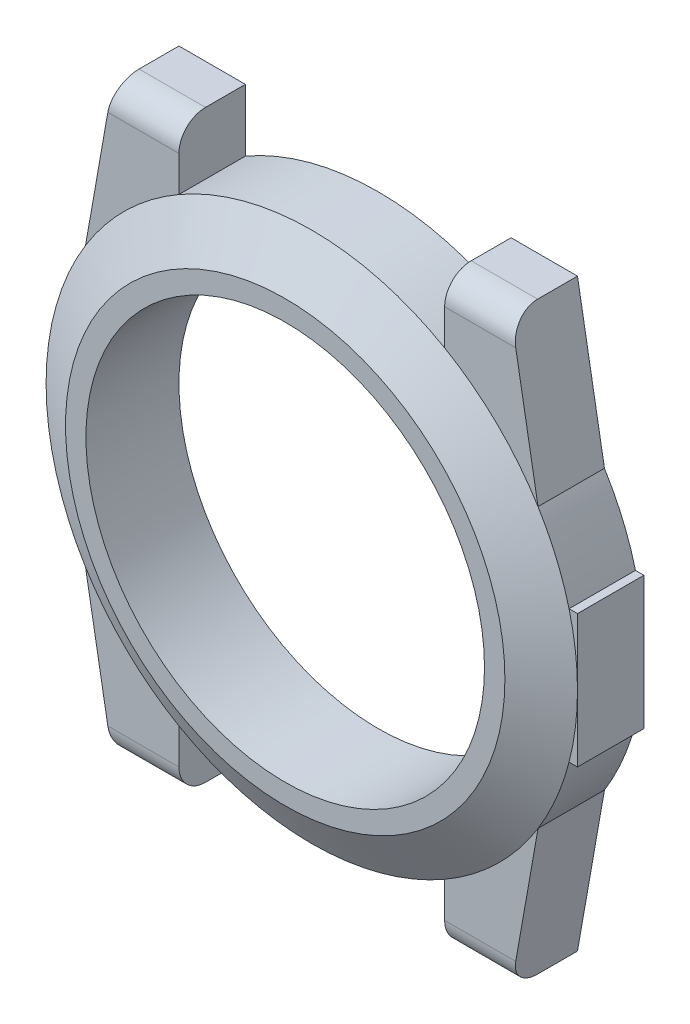
ISO-10303-21;
HEADER;
FILE_DESCRIPTION(('STEP AP214'),'2;1');
FILE_NAME('part.step','',(''),(''),'','','');
FILE_SCHEMA(('AUTOMOTIVE_DESIGN { 1 0 10303 214 1 1 1 1 }'));
ENDSEC;
DATA;
#1=APPLICATION_CONTEXT('core data for automotive mechanical design processes');
#2=APPLICATION_PROTOCOL_DEFINITION('international standard','automotive_design',2000,#1);
#3=PRODUCT_CONTEXT('',#1,'mechanical');
#4=PRODUCT('Part','Part','',(#3));
#5=PRODUCT_RELATED_PRODUCT_CATEGORY('part','',(#4));
#6=PRODUCT_DEFINITION_FORMATION('','',#4);
#7=PRODUCT_DEFINITION_CONTEXT('part definition',#1,'design');
#8=PRODUCT_DEFINITION('design','',#6,#7);
#9=PRODUCT_DEFINITION_SHAPE('','',#8);
#10=(LENGTH_UNIT() NAMED_UNIT(*) SI_UNIT(.MILLI.,.METRE.));
#11=(NAMED_UNIT(*) PLANE_ANGLE_UNIT() SI_UNIT($,.RADIAN.));
#12=(NAMED_UNIT(*) SI_UNIT($,.STERADIAN.) SOLID_ANGLE_UNIT());
#13=UNCERTAINTY_MEASURE_WITH_UNIT(LENGTH_MEASURE(1.E-05),#10,'distance_accuracy_value','');
#14=(GEOMETRIC_REPRESENTATION_CONTEXT(3) GLOBAL_UNCERTAINTY_ASSIGNED_CONTEXT((#13)) GLOBAL_UNIT_ASSIGNED_CONTEXT((#10,
#11,#12)) REPRESENTATION_CONTEXT('',''));
#15=CARTESIAN_POINT('',(0.,0.,0.));
#16=DIRECTION('',(0.,0.,1.));
#17=DIRECTION('',(1.,0.,0.));
#18=AXIS2_PLACEMENT_3D('',#15,#16,#17);
#19=CARTESIAN_POINT('',(0.,0.,5.));
#20=DIRECTION('',(0.,0.,-1.));
#21=DIRECTION('',(-1.,0.,0.));
#22=AXIS2_PLACEMENT_3D('',#19,#20,#21);
#23=CYLINDRICAL_SURFACE('',#22,20.);
#24=DIRECTION('',(0.,0.,-1.));
#25=VECTOR('',#24,1.);
#26=CARTESIAN_POINT('',(19.3649167310371,-5.00000000000001,5.));
#27=LINE('',#26,#25);
#28=CARTESIAN_POINT('',(19.3649167310371,-5.00000000000001,5.));
#29=VERTEX_POINT('',#28);
#30=CARTESIAN_POINT('',(19.3649167310371,-5.00000000000001,0.));
#31=VERTEX_POINT('',#30);
#32=EDGE_CURVE('E243',#29,#31,#27,.T.);
#33=ORIENTED_EDGE('',*,*,#32,.F.);
#34=CARTESIAN_POINT('',(0.,0.,5.));
#35=DIRECTION('',(0.,0.,1.));
#36=DIRECTION('',(1.,0.,0.));
#37=AXIS2_PLACEMENT_3D('',#34,#35,#36);
#38=CIRCLE('',#37,20.);
#39=CARTESIAN_POINT('',(17.0300508577456,-10.4870094775679,5.));
#40=VERTEX_POINT('',#39);
#41=EDGE_CURVE('E230',#29,#40,#38,.F.);
#42=ORIENTED_EDGE('',*,*,#41,.T.);
#43=DIRECTION('',(0.,0.,-1.));
#44=VECTOR('',#43,1.);
#45=CARTESIAN_POINT('',(17.0300508577456,-10.4870094775679,5.));
#46=LINE('',#45,#44);
#47=CARTESIAN_POINT('',(17.0300508577456,-10.4870094775679,0.));
#48=VERTEX_POINT('',#47);
#49=EDGE_CURVE('E246',#40,#48,#46,.T.);
#50=ORIENTED_EDGE('',*,*,#49,.T.);
#51=CARTESIAN_POINT('',(0.,0.,0.));
#52=DIRECTION('',(0.,0.,1.));
#53=DIRECTION('',(1.,0.,0.));
#54=AXIS2_PLACEMENT_3D('',#51,#52,#53);
#55=CIRCLE('',#54,20.);
#56=EDGE_CURVE('E483',#48,#31,#55,.T.);
#57=ORIENTED_EDGE('',*,*,#56,.T.);
#58=EDGE_LOOP('',(#33,#42,#50,#57));
#59=FACE_BOUND('',#58,.T.);
#60=ADVANCED_FACE('F33',(#59),#23,.T.);
#61=DIRECTION('',(0.,0.,-1.));
#62=VECTOR('',#61,1.);
#63=CARTESIAN_POINT('',(10.,-17.3205080756888,5.));
#64=LINE('',#63,#62);
#65=CARTESIAN_POINT('',(10.,-17.3205080756888,5.));
#66=VERTEX_POINT('',#65);
#67=CARTESIAN_POINT('',(10.,-17.3205080756888,0.));
#68=VERTEX_POINT('',#67);
#69=EDGE_CURVE('E286',#66,#68,#64,.T.);
#70=ORIENTED_EDGE('',*,*,#69,.F.);
#71=CARTESIAN_POINT('',(0.,0.,5.));
#72=DIRECTION('',(0.,0.,1.));
#73=DIRECTION('',(1.,0.,0.));
#74=AXIS2_PLACEMENT_3D('',#71,#72,#73);
#75=CIRCLE('',#74,20.);
#76=CARTESIAN_POINT('',(-10.,-17.3205080756888,5.));
#77=VERTEX_POINT('',#76);
#78=EDGE_CURVE('E383',#66,#77,#75,.F.);
#79=ORIENTED_EDGE('',*,*,#78,.T.);
#80=DIRECTION('',(0.,0.,-1.));
#81=VECTOR('',#80,1.);
#82=CARTESIAN_POINT('',(-10.,-17.3205080756888,5.));
#83=LINE('',#82,#81);
#84=CARTESIAN_POINT('',(-10.,-17.3205080756888,0.));
#85=VERTEX_POINT('',#84);
#86=EDGE_CURVE('E282',#77,#85,#83,.T.);
#87=ORIENTED_EDGE('',*,*,#86,.T.);
#88=CARTESIAN_POINT('',(0.,0.,0.));
#89=DIRECTION('',(0.,0.,1.));
#90=DIRECTION('',(1.,0.,0.));
#91=AXIS2_PLACEMENT_3D('',#88,#89,#90);
#92=CIRCLE('',#91,20.);
#93=EDGE_CURVE('E412',#85,#68,#92,.T.);
#94=ORIENTED_EDGE('',*,*,#93,.T.);
#95=EDGE_LOOP('',(#70,#79,#87,#94));
#96=FACE_BOUND('',#95,.T.);
#97=ADVANCED_FACE('F409',(#96),#23,.T.);
#98=DIRECTION('',(0.,0.,-1.));
#99=VECTOR('',#98,1.);
#100=CARTESIAN_POINT('',(-17.0300508577456,-10.4870094775679,5.));
#101=LINE('',#100,#99);
#102=CARTESIAN_POINT('',(-17.0300508577456,-10.4870094775679,5.));
#103=VERTEX_POINT('',#102);
#104=CARTESIAN_POINT('',(-17.0300508577456,-10.4870094775679,0.));
#105=VERTEX_POINT('',#104);
#106=EDGE_CURVE('E289',#103,#105,#101,.T.);
#107=ORIENTED_EDGE('',*,*,#106,.F.);
#108=CARTESIAN_POINT('',(0.,0.,5.));
#109=DIRECTION('',(0.,0.,1.));
#110=DIRECTION('',(1.,0.,0.));
#111=AXIS2_PLACEMENT_3D('',#108,#109,#110);
#112=CIRCLE('',#111,20.);
#113=CARTESIAN_POINT('',(-17.0300508577456,10.4870094775679,5.));
#114=VERTEX_POINT('',#113);
#115=EDGE_CURVE('E378',#103,#114,#112,.F.);
#116=ORIENTED_EDGE('',*,*,#115,.T.);
#117=DIRECTION('',(0.,0.,-1.));
#118=VECTOR('',#117,1.);
#119=CARTESIAN_POINT('',(-17.0300508577456,10.4870094775679,5.));
#120=LINE('',#119,#118);
#121=CARTESIAN_POINT('',(-17.0300508577456,10.4870094775679,0.));
#122=VERTEX_POINT('',#121);
#123=EDGE_CURVE('E292',#114,#122,#120,.T.);
#124=ORIENTED_EDGE('',*,*,#123,.T.);
#125=CARTESIAN_POINT('',(0.,0.,0.));
#126=DIRECTION('',(0.,0.,1.));
#127=DIRECTION('',(1.,0.,0.));
#128=AXIS2_PLACEMENT_3D('',#125,#126,#127);
#129=CIRCLE('',#128,20.);
#130=EDGE_CURVE('E465',#122,#105,#129,.T.);
#131=ORIENTED_EDGE('',*,*,#130,.T.);
#132=EDGE_LOOP('',(#107,#116,#124,#131));
#133=FACE_BOUND('',#132,.T.);
#134=ADVANCED_FACE('F550',(#133),#23,.T.);
#135=DIRECTION('',(0.,0.,-1.));
#136=VECTOR('',#135,1.);
#137=CARTESIAN_POINT('',(-10.,17.3205080756888,5.));
#138=LINE('',#137,#136);
#139=CARTESIAN_POINT('',(-10.,17.3205080756888,5.));
#140=VERTEX_POINT('',#139);
#141=CARTESIAN_POINT('',(-10.,17.3205080756888,0.));
#142=VERTEX_POINT('',#141);
#143=EDGE_CURVE('E232',#140,#142,#138,.T.);
#144=ORIENTED_EDGE('',*,*,#143,.F.);
#145=CARTESIAN_POINT('',(0.,0.,5.));
#146=DIRECTION('',(0.,0.,1.));
#147=DIRECTION('',(1.,0.,0.));
#148=AXIS2_PLACEMENT_3D('',#145,#146,#147);
#149=CIRCLE('',#148,20.);
#150=CARTESIAN_POINT('',(10.,17.3205080756888,5.));
#151=VERTEX_POINT('',#150);
#152=EDGE_CURVE('E373',#140,#151,#149,.F.);
#153=ORIENTED_EDGE('',*,*,#152,.T.);
#154=DIRECTION('',(0.,0.,-1.));
#155=VECTOR('',#154,1.);
#156=CARTESIAN_POINT('',(10.,17.3205080756888,5.));
#157=LINE('',#156,#155);
#158=CARTESIAN_POINT('',(10.,17.3205080756888,0.));
#159=VERTEX_POINT('',#158);
#160=EDGE_CURVE('E339',#151,#159,#157,.T.);
#161=ORIENTED_EDGE('',*,*,#160,.T.);
#162=CARTESIAN_POINT('',(0.,0.,0.));
#163=DIRECTION('',(0.,0.,1.));
#164=DIRECTION('',(1.,0.,0.));
#165=AXIS2_PLACEMENT_3D('',#162,#163,#164);
#166=CIRCLE('',#165,20.);
#167=EDGE_CURVE('E458',#159,#142,#166,.T.);
#168=ORIENTED_EDGE('',*,*,#167,.T.);
#169=EDGE_LOOP('',(#144,#153,#161,#168));
#170=FACE_BOUND('',#169,.T.);
#171=ADVANCED_FACE('F522',(#170),#23,.T.);
#172=CARTESIAN_POINT('',(0.,0.,5.));
#173=DIRECTION('',(0.,0.,1.));
#174=DIRECTION('',(1.,0.,0.));
#175=AXIS2_PLACEMENT_3D('',#172,#173,#174);
#176=PLANE('',#175);
#177=DIRECTION('',(-0.173648177666927,0.984807753012209,0.));
#178=VECTOR('',#177,1.);
#179=CARTESIAN_POINT('',(15.,22.,5.));
#180=LINE('',#179,#178);
#181=CARTESIAN_POINT('',(17.0300508577456,10.4870094775679,5.));
#182=VERTEX_POINT('',#181);
#183=CARTESIAN_POINT('',(15.3526539614169,20.,5.));
#184=VERTEX_POINT('',#183);
#185=EDGE_CURVE('E340',#182,#184,#180,.T.);
#186=ORIENTED_EDGE('',*,*,#185,.T.);
#187=DIRECTION('',(-1.,0.,0.));
#188=VECTOR('',#187,1.);
#189=CARTESIAN_POINT('',(10.,20.,5.));
#190=LINE('',#189,#188);
#191=CARTESIAN_POINT('',(10.,20.,5.));
#192=VERTEX_POINT('',#191);
#193=EDGE_CURVE('E330',#184,#192,#190,.T.);
#194=ORIENTED_EDGE('',*,*,#193,.T.);
#195=DIRECTION('',(0.,-1.,0.));
#196=VECTOR('',#195,1.);
#197=CARTESIAN_POINT('',(10.,17.3205080756888,5.));
#198=LINE('',#197,#196);
#199=EDGE_CURVE('E336',#192,#151,#198,.T.);
#200=ORIENTED_EDGE('',*,*,#199,.T.);
#201=CARTESIAN_POINT('',(0.,0.,5.));
#202=DIRECTION('',(0.,0.,1.));
#203=DIRECTION('',(1.,0.,0.));
#204=AXIS2_PLACEMENT_3D('',#201,#202,#203);
#205=CIRCLE('',#204,20.);
#206=EDGE_CURVE('E304',#182,#151,#205,.T.);
#207=ORIENTED_EDGE('',*,*,#206,.F.);
#208=EDGE_LOOP('',(#186,#194,#200,#207));
#209=FACE_BOUND('',#208,.T.);
#210=ADVANCED_FACE('F516',(#209),#176,.T.);
#211=DIRECTION('',(0.,1.,0.));
#212=VECTOR('',#211,1.);
#213=CARTESIAN_POINT('',(-10.,17.3205080756888,5.));
#214=LINE('',#213,#212);
#215=CARTESIAN_POINT('',(-10.,20.,5.));
#216=VERTEX_POINT('',#215);
#217=EDGE_CURVE('E311',#140,#216,#214,.T.);
#218=ORIENTED_EDGE('',*,*,#217,.T.);
#219=DIRECTION('',(-1.,0.,0.));
#220=VECTOR('',#219,1.);
#221=CARTESIAN_POINT('',(-15.,20.,5.));
#222=LINE('',#221,#220);
#223=CARTESIAN_POINT('',(-15.3526539614169,20.,5.));
#224=VERTEX_POINT('',#223);
#225=EDGE_CURVE('E314',#216,#224,#222,.T.);
#226=ORIENTED_EDGE('',*,*,#225,.T.);
#227=DIRECTION('',(-0.173648177666927,-0.984807753012209,0.));
#228=VECTOR('',#227,1.);
#229=CARTESIAN_POINT('',(-15.,22.,5.));
#230=LINE('',#229,#228);
#231=EDGE_CURVE('E298',#224,#114,#230,.T.);
#232=ORIENTED_EDGE('',*,*,#231,.T.);
#233=EDGE_CURVE('E301',#140,#114,#205,.T.);
#234=ORIENTED_EDGE('',*,*,#233,.F.);
#235=EDGE_LOOP('',(#218,#226,#232,#234));
#236=FACE_BOUND('',#235,.T.);
#237=ADVANCED_FACE('F567',(#236),#176,.T.);
#238=DIRECTION('',(0.173648177666927,-0.984807753012209,0.));
#239=VECTOR('',#238,1.);
#240=CARTESIAN_POINT('',(-15.,-22.,5.));
#241=LINE('',#240,#239);
#242=CARTESIAN_POINT('',(-15.3526539614169,-20.,5.));
#243=VERTEX_POINT('',#242);
#244=EDGE_CURVE('E276',#103,#243,#241,.T.);
#245=ORIENTED_EDGE('',*,*,#244,.T.);
#246=DIRECTION('',(1.,0.,0.));
#247=VECTOR('',#246,1.);
#248=CARTESIAN_POINT('',(-10.,-20.,5.));
#249=LINE('',#248,#247);
#250=CARTESIAN_POINT('',(-10.,-20.,5.));
#251=VERTEX_POINT('',#250);
#252=EDGE_CURVE('E272',#243,#251,#249,.T.);
#253=ORIENTED_EDGE('',*,*,#252,.T.);
#254=DIRECTION('',(0.,1.,0.));
#255=VECTOR('',#254,1.);
#256=CARTESIAN_POINT('',(-10.,-17.3205080756888,5.));
#257=LINE('',#256,#255);
#258=EDGE_CURVE('E273',#251,#77,#257,.T.);
#259=ORIENTED_EDGE('',*,*,#258,.T.);
#260=EDGE_CURVE('E234',#103,#77,#205,.T.);
#261=ORIENTED_EDGE('',*,*,#260,.F.);
#262=EDGE_LOOP('',(#245,#253,#259,#261));
#263=FACE_BOUND('',#262,.T.);
#264=ADVANCED_FACE('F673',(#263),#176,.T.);
#265=DIRECTION('',(0.,-1.,0.));
#266=VECTOR('',#265,1.);
#267=CARTESIAN_POINT('',(10.,-17.3205080756888,5.));
#268=LINE('',#267,#266);
#269=CARTESIAN_POINT('',(10.,-20.,5.));
#270=VERTEX_POINT('',#269);
#271=EDGE_CURVE('E260',#66,#270,#268,.T.);
#272=ORIENTED_EDGE('',*,*,#271,.T.);
#273=DIRECTION('',(1.,0.,0.));
#274=VECTOR('',#273,1.);
#275=CARTESIAN_POINT('',(15.,-20.,5.));
#276=LINE('',#275,#274);
#277=CARTESIAN_POINT('',(15.3526539614169,-20.,5.));
#278=VERTEX_POINT('',#277);
#279=EDGE_CURVE('E263',#270,#278,#276,.T.);
#280=ORIENTED_EDGE('',*,*,#279,.T.);
#281=DIRECTION('',(0.173648177666927,0.984807753012209,0.));
#282=VECTOR('',#281,1.);
#283=CARTESIAN_POINT('',(15.,-22.,5.));
#284=LINE('',#283,#282);
#285=EDGE_CURVE('E251',#278,#40,#284,.T.);
#286=ORIENTED_EDGE('',*,*,#285,.T.);
#287=EDGE_CURVE('E231',#66,#40,#205,.T.);
#288=ORIENTED_EDGE('',*,*,#287,.F.);
#289=EDGE_LOOP('',(#272,#280,#286,#288));
#290=FACE_BOUND('',#289,.T.);
#291=ADVANCED_FACE('F404',(#290),#176,.T.);
#292=CARTESIAN_POINT('',(20.,0.,5.));
#293=VERTEX_POINT('',#292);
#294=CARTESIAN_POINT('',(19.3649167310371,5.,5.));
#295=VERTEX_POINT('',#294);
#296=EDGE_CURVE('E218',#293,#295,#205,.T.);
#297=ORIENTED_EDGE('',*,*,#296,.F.);
#298=DIRECTION('',(0.,1.,0.));
#299=VECTOR('',#298,1.);
#300=CARTESIAN_POINT('',(20.,5.,5.));
#301=LINE('',#300,#299);
#302=CARTESIAN_POINT('',(20.,5.,5.));
#303=VERTEX_POINT('',#302);
#304=EDGE_CURVE('E207',#293,#303,#301,.T.);
#305=ORIENTED_EDGE('',*,*,#304,.T.);
#306=DIRECTION('',(-1.,0.,0.));
#307=VECTOR('',#306,1.);
#308=CARTESIAN_POINT('',(19.3649167310371,5.,5.));
#309=LINE('',#308,#307);
#310=EDGE_CURVE('E206',#303,#295,#309,.T.);
#311=ORIENTED_EDGE('',*,*,#310,.T.);
#312=EDGE_LOOP('',(#297,#305,#311));
#313=FACE_BOUND('',#312,.T.);
#314=ADVANCED_FACE('F219',(#313),#176,.T.);
#315=EDGE_CURVE('E199',#29,#293,#205,.T.);
#316=ORIENTED_EDGE('',*,*,#315,.F.);
#317=DIRECTION('',(1.,0.,0.));
#318=VECTOR('',#317,1.);
#319=CARTESIAN_POINT('',(20.,-5.,5.));
#320=LINE('',#319,#318);
#321=CARTESIAN_POINT('',(20.,-5.,5.));
#322=VERTEX_POINT('',#321);
#323=EDGE_CURVE('E202',#29,#322,#320,.T.);
#324=ORIENTED_EDGE('',*,*,#323,.T.);
#325=EDGE_CURVE('E195',#322,#293,#301,.T.);
#326=ORIENTED_EDGE('',*,*,#325,.T.);
#327=EDGE_LOOP('',(#316,#324,#326));
#328=FACE_BOUND('',#327,.T.);
#329=ADVANCED_FACE('F197',(#328),#176,.T.);
#330=CARTESIAN_POINT('',(0.,0.,0.));
#331=DIRECTION('',(0.,0.,1.));
#332=DIRECTION('',(1.,0.,0.));
#333=AXIS2_PLACEMENT_3D('',#330,#331,#332);
#334=PLANE('',#333);
#335=ORIENTED_EDGE('',*,*,#167,.F.);
#336=DIRECTION('',(0.,-1.,0.));
#337=VECTOR('',#336,1.);
#338=CARTESIAN_POINT('',(10.,17.3205080756888,0.));
#339=LINE('',#338,#337);
#340=CARTESIAN_POINT('',(10.,22.,0.));
#341=VERTEX_POINT('',#340);
#342=EDGE_CURVE('E499',#341,#159,#339,.T.);
#343=ORIENTED_EDGE('',*,*,#342,.F.);
#344=DIRECTION('',(-1.,0.,0.));
#345=VECTOR('',#344,1.);
#346=CARTESIAN_POINT('',(10.,22.,0.));
#347=LINE('',#346,#345);
#348=CARTESIAN_POINT('',(15.,22.,0.));
#349=VERTEX_POINT('',#348);
#350=EDGE_CURVE('E496',#349,#341,#347,.T.);
#351=ORIENTED_EDGE('',*,*,#350,.F.);
#352=DIRECTION('',(-0.173648177666927,0.984807753012209,0.));
#353=VECTOR('',#352,1.);
#354=CARTESIAN_POINT('',(15.,22.,0.));
#355=LINE('',#354,#353);
#356=CARTESIAN_POINT('',(17.0300508577456,10.4870094775679,0.));
#357=VERTEX_POINT('',#356);
#358=EDGE_CURVE('E493',#357,#349,#355,.T.);
#359=ORIENTED_EDGE('',*,*,#358,.F.);
#360=CARTESIAN_POINT('',(0.,0.,0.));
#361=DIRECTION('',(0.,0.,1.));
#362=DIRECTION('',(1.,0.,0.));
#363=AXIS2_PLACEMENT_3D('',#360,#361,#362);
#364=CIRCLE('',#363,20.);
#365=CARTESIAN_POINT('',(19.3649167310371,5.,0.));
#366=VERTEX_POINT('',#365);
#367=EDGE_CURVE('E491',#366,#357,#364,.T.);
#368=ORIENTED_EDGE('',*,*,#367,.F.);
#369=DIRECTION('',(-1.,0.,0.));
#370=VECTOR('',#369,1.);
#371=CARTESIAN_POINT('',(19.3649167310371,5.,0.));
#372=LINE('',#371,#370);
#373=CARTESIAN_POINT('',(20.,5.,0.));
#374=VERTEX_POINT('',#373);
#375=EDGE_CURVE('E489',#374,#366,#372,.T.);
#376=ORIENTED_EDGE('',*,*,#375,.F.);
#377=DIRECTION('',(0.,1.,0.));
#378=VECTOR('',#377,1.);
#379=CARTESIAN_POINT('',(20.,5.,0.));
#380=LINE('',#379,#378);
#381=CARTESIAN_POINT('',(20.,-5.,0.));
#382=VERTEX_POINT('',#381);
#383=EDGE_CURVE('E487',#382,#374,#380,.T.);
#384=ORIENTED_EDGE('',*,*,#383,.F.);
#385=DIRECTION('',(1.,0.,0.));
#386=VECTOR('',#385,1.);
#387=CARTESIAN_POINT('',(20.,-5.,0.));
#388=LINE('',#387,#386);
#389=EDGE_CURVE('E485',#31,#382,#388,.T.);
#390=ORIENTED_EDGE('',*,*,#389,.F.);
#391=ORIENTED_EDGE('',*,*,#56,.F.);
#392=DIRECTION('',(0.173648177666927,0.984807753012209,0.));
#393=VECTOR('',#392,1.);
#394=CARTESIAN_POINT('',(15.,-22.,0.));
#395=LINE('',#394,#393);
#396=CARTESIAN_POINT('',(15.,-22.,0.));
#397=VERTEX_POINT('',#396);
#398=EDGE_CURVE('E397',#397,#48,#395,.T.);
#399=ORIENTED_EDGE('',*,*,#398,.F.);
#400=DIRECTION('',(1.,0.,0.));
#401=VECTOR('',#400,1.);
#402=CARTESIAN_POINT('',(10.,-22.,0.));
#403=LINE('',#402,#401);
#404=CARTESIAN_POINT('',(10.,-22.,0.));
#405=VERTEX_POINT('',#404);
#406=EDGE_CURVE('E434',#405,#397,#403,.T.);
#407=ORIENTED_EDGE('',*,*,#406,.F.);
#408=DIRECTION('',(0.,-1.,0.));
#409=VECTOR('',#408,1.);
#410=CARTESIAN_POINT('',(10.,-17.3205080756888,0.));
#411=LINE('',#410,#409);
#412=EDGE_CURVE('E479',#68,#405,#411,.T.);
#413=ORIENTED_EDGE('',*,*,#412,.F.);
#414=ORIENTED_EDGE('',*,*,#93,.F.);
#415=DIRECTION('',(0.,1.,0.));
#416=VECTOR('',#415,1.);
#417=CARTESIAN_POINT('',(-10.,-17.3205080756888,0.));
#418=LINE('',#417,#416);
#419=CARTESIAN_POINT('',(-10.,-22.,0.));
#420=VERTEX_POINT('',#419);
#421=EDGE_CURVE('E476',#420,#85,#418,.T.);
#422=ORIENTED_EDGE('',*,*,#421,.F.);
#423=DIRECTION('',(1.,0.,0.));
#424=VECTOR('',#423,1.);
#425=CARTESIAN_POINT('',(-10.,-22.,0.));
#426=LINE('',#425,#424);
#427=CARTESIAN_POINT('',(-15.,-22.,0.));
#428=VERTEX_POINT('',#427);
#429=EDGE_CURVE('E473',#428,#420,#426,.T.);
#430=ORIENTED_EDGE('',*,*,#429,.F.);
#431=DIRECTION('',(0.173648177666927,-0.984807753012209,0.));
#432=VECTOR('',#431,1.);
#433=CARTESIAN_POINT('',(-15.,-22.,0.));
#434=LINE('',#433,#432);
#435=EDGE_CURVE('E470',#105,#428,#434,.T.);
#436=ORIENTED_EDGE('',*,*,#435,.F.);
#437=ORIENTED_EDGE('',*,*,#130,.F.);
#438=DIRECTION('',(-0.173648177666927,-0.984807753012209,0.));
#439=VECTOR('',#438,1.);
#440=CARTESIAN_POINT('',(-15.,22.,0.));
#441=LINE('',#440,#439);
#442=CARTESIAN_POINT('',(-15.,22.,0.));
#443=VERTEX_POINT('',#442);
#444=EDGE_CURVE('E463',#443,#122,#441,.T.);
#445=ORIENTED_EDGE('',*,*,#444,.F.);
#446=DIRECTION('',(-1.,0.,0.));
#447=VECTOR('',#446,1.);
#448=CARTESIAN_POINT('',(-10.,22.,0.));
#449=LINE('',#448,#447);
#450=CARTESIAN_POINT('',(-10.,22.,0.));
#451=VERTEX_POINT('',#450);
#452=EDGE_CURVE('E447',#451,#443,#449,.T.);
#453=ORIENTED_EDGE('',*,*,#452,.F.);
#454=DIRECTION('',(0.,1.,0.));
#455=VECTOR('',#454,1.);
#456=CARTESIAN_POINT('',(-10.,17.3205080756888,0.));
#457=LINE('',#456,#455);
#458=EDGE_CURVE('E451',#142,#451,#457,.T.);
#459=ORIENTED_EDGE('',*,*,#458,.F.);
#460=EDGE_LOOP('',(#335,#343,#351,#359,#368,#376,#384,#390,#391,#399,#407,#413,#414,#422,#430,
#436,#437,#445,#453,#459));
#461=FACE_BOUND('',#460,.T.);
#462=CARTESIAN_POINT('',(0.,0.,0.));
#463=DIRECTION('',(0.,0.,1.));
#464=DIRECTION('',(1.,0.,0.));
#465=AXIS2_PLACEMENT_3D('',#462,#463,#464);
#466=CIRCLE('',#465,15.);
#467=CARTESIAN_POINT('',(15.,0.,0.));
#468=VERTEX_POINT('',#467);
#469=EDGE_CURVE('E223',#468,#468,#466,.T.);
#470=ORIENTED_EDGE('',*,*,#469,.T.);
#471=EDGE_LOOP('',(#470));
#472=FACE_BOUND('',#471,.T.);
#473=ADVANCED_FACE('F460',(#461,#472),#334,.F.);
#474=CARTESIAN_POINT('',(-10.,17.3205080756888,5.));
#475=DIRECTION('',(-1.,0.,0.));
#476=DIRECTION('',(0.,0.,1.));
#477=AXIS2_PLACEMENT_3D('',#474,#475,#476);
#478=PLANE('',#477);
#479=DIRECTION('',(0.,0.,-1.));
#480=VECTOR('',#479,1.);
#481=CARTESIAN_POINT('',(-10.,22.,5.));
#482=LINE('',#481,#480);
#483=CARTESIAN_POINT('',(-10.,22.,3.));
#484=VERTEX_POINT('',#483);
#485=EDGE_CURVE('E237',#484,#451,#482,.T.);
#486=ORIENTED_EDGE('',*,*,#485,.F.);
#487=CARTESIAN_POINT('',(-10.,20.,3.));
#488=DIRECTION('',(-1.,0.,0.));
#489=DIRECTION('',(0.,0.,1.));
#490=AXIS2_PLACEMENT_3D('',#487,#488,#489);
#491=CIRCLE('',#490,2.);
#492=EDGE_CURVE('E11',#484,#216,#491,.F.);
#493=ORIENTED_EDGE('',*,*,#492,.T.);
#494=ORIENTED_EDGE('',*,*,#217,.F.);
#495=ORIENTED_EDGE('',*,*,#143,.T.);
#496=ORIENTED_EDGE('',*,*,#458,.T.);
#497=EDGE_LOOP('',(#486,#493,#494,#495,#496));
#498=FACE_BOUND('',#497,.T.);
#499=ADVANCED_FACE('F452',(#498),#478,.F.);
#500=CARTESIAN_POINT('',(-10.,22.,5.));
#501=DIRECTION('',(0.,-1.,0.));
#502=DIRECTION('',(1.,0.,0.));
#503=AXIS2_PLACEMENT_3D('',#500,#501,#502);
#504=PLANE('',#503);
#505=DIRECTION('',(0.,0.,-1.));
#506=VECTOR('',#505,1.);
#507=CARTESIAN_POINT('',(-15.,22.,5.));
#508=LINE('',#507,#506);
#509=CARTESIAN_POINT('',(-15.,22.,3.));
#510=VERTEX_POINT('',#509);
#511=EDGE_CURVE('E442',#510,#443,#508,.T.);
#512=ORIENTED_EDGE('',*,*,#511,.F.);
#513=DIRECTION('',(-1.,0.,0.));
#514=VECTOR('',#513,1.);
#515=CARTESIAN_POINT('',(-10.,22.,3.));
#516=LINE('',#515,#514);
#517=EDGE_CURVE('E41',#510,#484,#516,.F.);
#518=ORIENTED_EDGE('',*,*,#517,.T.);
#519=ORIENTED_EDGE('',*,*,#485,.T.);
#520=ORIENTED_EDGE('',*,*,#452,.T.);
#521=EDGE_LOOP('',(#512,#518,#519,#520));
#522=FACE_BOUND('',#521,.T.);
#523=ADVANCED_FACE('F445',(#522),#504,.F.);
#524=CARTESIAN_POINT('',(-15.,22.,5.));
#525=DIRECTION('',(0.984807753012209,-0.173648177666927,0.));
#526=DIRECTION('',(0.173648177666927,0.984807753012209,0.));
#527=AXIS2_PLACEMENT_3D('',#524,#525,#526);
#528=PLANE('',#527);
#529=ORIENTED_EDGE('',*,*,#231,.F.);
#530=CARTESIAN_POINT('',(-15.3526539614169,20.,3.));
#531=DIRECTION('',(0.984807753012209,-0.173648177666927,0.));
#532=DIRECTION('',(0.173648177666927,0.984807753012209,0.));
#533=AXIS2_PLACEMENT_3D('',#530,#531,#532);
#534=ELLIPSE('',#533,2.03085322377149,2.);
#535=EDGE_CURVE('E55',#224,#510,#534,.F.);
#536=ORIENTED_EDGE('',*,*,#535,.T.);
#537=ORIENTED_EDGE('',*,*,#511,.T.);
#538=ORIENTED_EDGE('',*,*,#444,.T.);
#539=ORIENTED_EDGE('',*,*,#123,.F.);
#540=EDGE_LOOP('',(#529,#536,#537,#538,#539));
#541=FACE_BOUND('',#540,.T.);
#542=ADVANCED_FACE('F610',(#541),#528,.F.);
#543=CARTESIAN_POINT('',(-15.,-22.,5.));
#544=DIRECTION('',(0.984807753012209,0.173648177666927,0.));
#545=DIRECTION('',(-0.173648177666927,0.984807753012209,0.));
#546=AXIS2_PLACEMENT_3D('',#543,#544,#545);
#547=PLANE('',#546);
#548=DIRECTION('',(0.,0.,-1.));
#549=VECTOR('',#548,1.);
#550=CARTESIAN_POINT('',(-15.,-22.,5.));
#551=LINE('',#550,#549);
#552=CARTESIAN_POINT('',(-15.,-22.,3.));
#553=VERTEX_POINT('',#552);
#554=EDGE_CURVE('E293',#553,#428,#551,.T.);
#555=ORIENTED_EDGE('',*,*,#554,.F.);
#556=CARTESIAN_POINT('',(-15.3526539614169,-20.,3.));
#557=DIRECTION('',(0.984807753012209,0.173648177666927,0.));
#558=DIRECTION('',(-0.173648177666927,0.984807753012209,0.));
#559=AXIS2_PLACEMENT_3D('',#556,#557,#558);
#560=ELLIPSE('',#559,2.03085322377149,2.);
#561=EDGE_CURVE('E335',#553,#243,#560,.F.);
#562=ORIENTED_EDGE('',*,*,#561,.T.);
#563=ORIENTED_EDGE('',*,*,#244,.F.);
#564=ORIENTED_EDGE('',*,*,#106,.T.);
#565=ORIENTED_EDGE('',*,*,#435,.T.);
#566=EDGE_LOOP('',(#555,#562,#563,#564,#565));
#567=FACE_BOUND('',#566,.T.);
#568=ADVANCED_FACE('F580',(#567),#547,.F.);
#569=CARTESIAN_POINT('',(-10.,-22.,5.));
#570=DIRECTION('',(0.,1.,0.));
#571=DIRECTION('',(-1.,0.,0.));
#572=AXIS2_PLACEMENT_3D('',#569,#570,#571);
#573=PLANE('',#572);
#574=DIRECTION('',(0.,0.,-1.));
#575=VECTOR('',#574,1.);
#576=CARTESIAN_POINT('',(-10.,-22.,5.));
#577=LINE('',#576,#575);
#578=CARTESIAN_POINT('',(-10.,-22.,3.));
#579=VERTEX_POINT('',#578);
#580=EDGE_CURVE('E285',#579,#420,#577,.T.);
#581=ORIENTED_EDGE('',*,*,#580,.F.);
#582=DIRECTION('',(1.,0.,0.));
#583=VECTOR('',#582,1.);
#584=CARTESIAN_POINT('',(-15.,-22.,3.));
#585=LINE('',#584,#583);
#586=EDGE_CURVE('E914',#579,#553,#585,.F.);
#587=ORIENTED_EDGE('',*,*,#586,.T.);
#588=ORIENTED_EDGE('',*,*,#554,.T.);
#589=ORIENTED_EDGE('',*,*,#429,.T.);
#590=EDGE_LOOP('',(#581,#587,#588,#589));
#591=FACE_BOUND('',#590,.T.);
#592=ADVANCED_FACE('F615',(#591),#573,.F.);
#593=CARTESIAN_POINT('',(-10.,-17.3205080756888,5.));
#594=DIRECTION('',(-1.,0.,0.));
#595=DIRECTION('',(0.,0.,1.));
#596=AXIS2_PLACEMENT_3D('',#593,#594,#595);
#597=PLANE('',#596);
#598=ORIENTED_EDGE('',*,*,#258,.F.);
#599=CARTESIAN_POINT('',(-10.,-20.,3.));
#600=DIRECTION('',(-1.,0.,0.));
#601=DIRECTION('',(0.,0.,1.));
#602=AXIS2_PLACEMENT_3D('',#599,#600,#601);
#603=CIRCLE('',#602,2.);
#604=EDGE_CURVE('E912',#251,#579,#603,.F.);
#605=ORIENTED_EDGE('',*,*,#604,.T.);
#606=ORIENTED_EDGE('',*,*,#580,.T.);
#607=ORIENTED_EDGE('',*,*,#421,.T.);
#608=ORIENTED_EDGE('',*,*,#86,.F.);
#609=EDGE_LOOP('',(#598,#605,#606,#607,#608));
#610=FACE_BOUND('',#609,.T.);
#611=ADVANCED_FACE('F618',(#610),#597,.F.);
#612=CARTESIAN_POINT('',(10.,-17.3205080756888,5.));
#613=DIRECTION('',(1.,0.,0.));
#614=DIRECTION('',(0.,0.,-1.));
#615=AXIS2_PLACEMENT_3D('',#612,#613,#614);
#616=PLANE('',#615);
#617=DIRECTION('',(0.,0.,-1.));
#618=VECTOR('',#617,1.);
#619=CARTESIAN_POINT('',(10.,-22.,5.));
#620=LINE('',#619,#618);
#621=CARTESIAN_POINT('',(10.,-22.,3.));
#622=VERTEX_POINT('',#621);
#623=EDGE_CURVE('E416',#622,#405,#620,.T.);
#624=ORIENTED_EDGE('',*,*,#623,.F.);
#625=CARTESIAN_POINT('',(10.,-20.,3.));
#626=DIRECTION('',(1.,0.,0.));
#627=DIRECTION('',(0.,0.,-1.));
#628=AXIS2_PLACEMENT_3D('',#625,#626,#627);
#629=CIRCLE('',#628,2.);
#630=EDGE_CURVE('E270',#622,#270,#629,.F.);
#631=ORIENTED_EDGE('',*,*,#630,.T.);
#632=ORIENTED_EDGE('',*,*,#271,.F.);
#633=ORIENTED_EDGE('',*,*,#69,.T.);
#634=ORIENTED_EDGE('',*,*,#412,.T.);
#635=EDGE_LOOP('',(#624,#631,#632,#633,#634));
#636=FACE_BOUND('',#635,.T.);
#637=ADVANCED_FACE('F419',(#636),#616,.F.);
#638=CARTESIAN_POINT('',(10.,-22.,5.));
#639=DIRECTION('',(0.,1.,0.));
#640=DIRECTION('',(-1.,0.,0.));
#641=AXIS2_PLACEMENT_3D('',#638,#639,#640);
#642=PLANE('',#641);
#643=DIRECTION('',(0.,0.,-1.));
#644=VECTOR('',#643,1.);
#645=CARTESIAN_POINT('',(15.,-22.,5.));
#646=LINE('',#645,#644);
#647=CARTESIAN_POINT('',(15.,-22.,3.));
#648=VERTEX_POINT('',#647);
#649=EDGE_CURVE('E398',#648,#397,#646,.T.);
#650=ORIENTED_EDGE('',*,*,#649,.F.);
#651=DIRECTION('',(1.,0.,0.));
#652=VECTOR('',#651,1.);
#653=CARTESIAN_POINT('',(10.,-22.,3.));
#654=LINE('',#653,#652);
#655=EDGE_CURVE('E268',#648,#622,#654,.F.);
#656=ORIENTED_EDGE('',*,*,#655,.T.);
#657=ORIENTED_EDGE('',*,*,#623,.T.);
#658=ORIENTED_EDGE('',*,*,#406,.T.);
#659=EDGE_LOOP('',(#650,#656,#657,#658));
#660=FACE_BOUND('',#659,.T.);
#661=ADVANCED_FACE('F432',(#660),#642,.F.);
#662=CARTESIAN_POINT('',(15.,-22.,5.));
#663=DIRECTION('',(-0.984807753012209,0.173648177666927,0.));
#664=DIRECTION('',(-0.173648177666927,-0.984807753012209,0.));
#665=AXIS2_PLACEMENT_3D('',#662,#663,#664);
#666=PLANE('',#665);
#667=ORIENTED_EDGE('',*,*,#285,.F.);
#668=CARTESIAN_POINT('',(15.3526539614169,-20.,3.));
#669=DIRECTION('',(-0.984807753012209,0.173648177666927,0.));
#670=DIRECTION('',(-0.173648177666927,-0.984807753012209,0.));
#671=AXIS2_PLACEMENT_3D('',#668,#669,#670);
#672=ELLIPSE('',#671,2.03085322377149,2.);
#673=EDGE_CURVE('E266',#278,#648,#672,.F.);
#674=ORIENTED_EDGE('',*,*,#673,.T.);
#675=ORIENTED_EDGE('',*,*,#649,.T.);
#676=ORIENTED_EDGE('',*,*,#398,.T.);
#677=ORIENTED_EDGE('',*,*,#49,.F.);
#678=EDGE_LOOP('',(#667,#674,#675,#676,#677));
#679=FACE_BOUND('',#678,.T.);
#680=ADVANCED_FACE('F395',(#679),#666,.F.);
#681=CARTESIAN_POINT('',(20.,-5.,5.));
#682=DIRECTION('',(0.,1.,0.));
#683=DIRECTION('',(-1.,0.,0.));
#684=AXIS2_PLACEMENT_3D('',#681,#682,#683);
#685=PLANE('',#684);
#686=ORIENTED_EDGE('',*,*,#389,.T.);
#687=DIRECTION('',(0.,0.,-1.));
#688=VECTOR('',#687,1.);
#689=CARTESIAN_POINT('',(20.,-5.,5.));
#690=LINE('',#689,#688);
#691=EDGE_CURVE('E247',#322,#382,#690,.T.);
#692=ORIENTED_EDGE('',*,*,#691,.F.);
#693=ORIENTED_EDGE('',*,*,#323,.F.);
#694=ORIENTED_EDGE('',*,*,#32,.T.);
#695=EDGE_LOOP('',(#686,#692,#693,#694));
#696=FACE_BOUND('',#695,.T.);
#697=ADVANCED_FACE('F629',(#696),#685,.F.);
#698=CARTESIAN_POINT('',(20.,5.,5.));
#699=DIRECTION('',(-1.,0.,0.));
#700=DIRECTION('',(0.,0.,1.));
#701=AXIS2_PLACEMENT_3D('',#698,#699,#700);
#702=PLANE('',#701);
#703=ORIENTED_EDGE('',*,*,#383,.T.);
#704=DIRECTION('',(0.,0.,-1.));
#705=VECTOR('',#704,1.);
#706=CARTESIAN_POINT('',(20.,5.,5.));
#707=LINE('',#706,#705);
#708=EDGE_CURVE('E213',#303,#374,#707,.T.);
#709=ORIENTED_EDGE('',*,*,#708,.F.);
#710=ORIENTED_EDGE('',*,*,#304,.F.);
#711=ORIENTED_EDGE('',*,*,#325,.F.);
#712=ORIENTED_EDGE('',*,*,#691,.T.);
#713=EDGE_LOOP('',(#703,#709,#710,#711,#712));
#714=FACE_BOUND('',#713,.T.);
#715=ADVANCED_FACE('F211',(#714),#702,.F.);
#716=CARTESIAN_POINT('',(19.3649167310371,5.,5.));
#717=DIRECTION('',(0.,-1.,0.));
#718=DIRECTION('',(1.,0.,0.));
#719=AXIS2_PLACEMENT_3D('',#716,#717,#718);
#720=PLANE('',#719);
#721=ORIENTED_EDGE('',*,*,#375,.T.);
#722=DIRECTION('',(0.,0.,-1.));
#723=VECTOR('',#722,1.);
#724=CARTESIAN_POINT('',(19.3649167310371,5.,5.));
#725=LINE('',#724,#723);
#726=EDGE_CURVE('E354',#295,#366,#725,.T.);
#727=ORIENTED_EDGE('',*,*,#726,.F.);
#728=ORIENTED_EDGE('',*,*,#310,.F.);
#729=ORIENTED_EDGE('',*,*,#708,.T.);
#730=EDGE_LOOP('',(#721,#727,#728,#729));
#731=FACE_BOUND('',#730,.T.);
#732=ADVANCED_FACE('F509',(#731),#720,.F.);
#733=DIRECTION('',(0.,0.,-1.));
#734=VECTOR('',#733,1.);
#735=CARTESIAN_POINT('',(17.0300508577456,10.4870094775679,5.));
#736=LINE('',#735,#734);
#737=EDGE_CURVE('E351',#182,#357,#736,.T.);
#738=ORIENTED_EDGE('',*,*,#737,.F.);
#739=CARTESIAN_POINT('',(0.,0.,5.));
#740=DIRECTION('',(0.,0.,1.));
#741=DIRECTION('',(1.,0.,0.));
#742=AXIS2_PLACEMENT_3D('',#739,#740,#741);
#743=CIRCLE('',#742,20.);
#744=EDGE_CURVE('E371',#182,#295,#743,.F.);
#745=ORIENTED_EDGE('',*,*,#744,.T.);
#746=ORIENTED_EDGE('',*,*,#726,.T.);
#747=ORIENTED_EDGE('',*,*,#367,.T.);
#748=EDGE_LOOP('',(#738,#745,#746,#747));
#749=FACE_BOUND('',#748,.T.);
#750=ADVANCED_FACE('F512',(#749),#23,.T.);
#751=CARTESIAN_POINT('',(15.,22.,5.));
#752=DIRECTION('',(-0.984807753012209,-0.173648177666927,0.));
#753=DIRECTION('',(0.173648177666927,-0.984807753012209,0.));
#754=AXIS2_PLACEMENT_3D('',#751,#752,#753);
#755=PLANE('',#754);
#756=DIRECTION('',(0.,0.,-1.));
#757=VECTOR('',#756,1.);
#758=CARTESIAN_POINT('',(15.,22.,5.));
#759=LINE('',#758,#757);
#760=CARTESIAN_POINT('',(15.,22.,3.));
#761=VERTEX_POINT('',#760);
#762=EDGE_CURVE('E355',#761,#349,#759,.T.);
#763=ORIENTED_EDGE('',*,*,#762,.F.);
#764=CARTESIAN_POINT('',(15.3526539614169,20.,3.));
#765=DIRECTION('',(-0.984807753012209,-0.173648177666927,0.));
#766=DIRECTION('',(0.173648177666927,-0.984807753012209,0.));
#767=AXIS2_PLACEMENT_3D('',#764,#765,#766);
#768=ELLIPSE('',#767,2.03085322377149,2.);
#769=EDGE_CURVE('E312',#761,#184,#768,.F.);
#770=ORIENTED_EDGE('',*,*,#769,.T.);
#771=ORIENTED_EDGE('',*,*,#185,.F.);
#772=ORIENTED_EDGE('',*,*,#737,.T.);
#773=ORIENTED_EDGE('',*,*,#358,.T.);
#774=EDGE_LOOP('',(#763,#770,#771,#772,#773));
#775=FACE_BOUND('',#774,.T.);
#776=ADVANCED_FACE('F554',(#775),#755,.F.);
#777=CARTESIAN_POINT('',(10.,22.,5.));
#778=DIRECTION('',(0.,-1.,0.));
#779=DIRECTION('',(1.,0.,0.));
#780=AXIS2_PLACEMENT_3D('',#777,#778,#779);
#781=PLANE('',#780);
#782=DIRECTION('',(0.,0.,-1.));
#783=VECTOR('',#782,1.);
#784=CARTESIAN_POINT('',(10.,22.,5.));
#785=LINE('',#784,#783);
#786=CARTESIAN_POINT('',(10.,22.,3.));
#787=VERTEX_POINT('',#786);
#788=EDGE_CURVE('E348',#787,#341,#785,.T.);
#789=ORIENTED_EDGE('',*,*,#788,.F.);
#790=DIRECTION('',(-1.,0.,0.));
#791=VECTOR('',#790,1.);
#792=CARTESIAN_POINT('',(15.,22.,3.));
#793=LINE('',#792,#791);
#794=EDGE_CURVE('E320',#787,#761,#793,.F.);
#795=ORIENTED_EDGE('',*,*,#794,.T.);
#796=ORIENTED_EDGE('',*,*,#762,.T.);
#797=ORIENTED_EDGE('',*,*,#350,.T.);
#798=EDGE_LOOP('',(#789,#795,#796,#797));
#799=FACE_BOUND('',#798,.T.);
#800=ADVANCED_FACE('F560',(#799),#781,.F.);
#801=CARTESIAN_POINT('',(10.,17.3205080756888,5.));
#802=DIRECTION('',(1.,0.,0.));
#803=DIRECTION('',(0.,0.,-1.));
#804=AXIS2_PLACEMENT_3D('',#801,#802,#803);
#805=PLANE('',#804);
#806=ORIENTED_EDGE('',*,*,#199,.F.);
#807=CARTESIAN_POINT('',(10.,20.,3.));
#808=DIRECTION('',(1.,0.,0.));
#809=DIRECTION('',(0.,0.,-1.));
#810=AXIS2_PLACEMENT_3D('',#807,#808,#809);
#811=CIRCLE('',#810,2.);
#812=EDGE_CURVE('E326',#192,#787,#811,.F.);
#813=ORIENTED_EDGE('',*,*,#812,.T.);
#814=ORIENTED_EDGE('',*,*,#788,.T.);
#815=ORIENTED_EDGE('',*,*,#342,.T.);
#816=ORIENTED_EDGE('',*,*,#160,.F.);
#817=EDGE_LOOP('',(#806,#813,#814,#815,#816));
#818=FACE_BOUND('',#817,.T.);
#819=ADVANCED_FACE('F523',(#818),#805,.F.);
#820=CARTESIAN_POINT('',(0.,0.,5.));
#821=DIRECTION('',(0.,0.,-1.));
#822=DIRECTION('',(-1.,0.,0.));
#823=AXIS2_PLACEMENT_3D('',#820,#821,#822);
#824=CYLINDRICAL_SURFACE('',#823,15.);
#825=ORIENTED_EDGE('',*,*,#469,.F.);
#826=EDGE_LOOP('',(#825));
#827=FACE_BOUND('',#826,.T.);
#828=CARTESIAN_POINT('',(0.,0.,7.));
#829=DIRECTION('',(0.,0.,1.));
#830=DIRECTION('',(1.,0.,0.));
#831=AXIS2_PLACEMENT_3D('',#828,#829,#830);
#832=CIRCLE('',#831,15.);
#833=CARTESIAN_POINT('',(15.,0.,7.));
#834=VERTEX_POINT('',#833);
#835=EDGE_CURVE('E224',#834,#834,#832,.T.);
#836=ORIENTED_EDGE('',*,*,#835,.T.);
#837=EDGE_LOOP('',(#836));
#838=FACE_BOUND('',#837,.T.);
#839=ADVANCED_FACE('F532',(#827,#838),#824,.F.);
#840=CARTESIAN_POINT('',(0.,0.,7.));
#841=DIRECTION('',(0.,0.,1.));
#842=DIRECTION('',(1.,0.,0.));
#843=AXIS2_PLACEMENT_3D('',#840,#841,#842);
#844=PLANE('',#843);
#845=CARTESIAN_POINT('',(0.,0.,7.));
#846=DIRECTION('',(0.,0.,1.));
#847=DIRECTION('',(1.,0.,0.));
#848=AXIS2_PLACEMENT_3D('',#845,#846,#847);
#849=CIRCLE('',#848,16.5358983848622);
#850=CARTESIAN_POINT('',(16.5358983848622,0.,7.));
#851=VERTEX_POINT('',#850);
#852=EDGE_CURVE('E368',#851,#851,#849,.T.);
#853=ORIENTED_EDGE('',*,*,#852,.T.);
#854=EDGE_LOOP('',(#853));
#855=FACE_BOUND('',#854,.T.);
#856=ORIENTED_EDGE('',*,*,#835,.F.);
#857=EDGE_LOOP('',(#856));
#858=FACE_BOUND('',#857,.T.);
#859=ADVANCED_FACE('F534',(#855,#858),#844,.T.);
#860=CARTESIAN_POINT('',(0.,0.,7.));
#861=DIRECTION('',(0.,0.,-1.));
#862=DIRECTION('',(-1.,0.,0.));
#863=AXIS2_PLACEMENT_3D('',#860,#861,#862);
#864=CONICAL_SURFACE('',#863,16.5358983848622,1.0471975511966);
#865=ORIENTED_EDGE('',*,*,#41,.F.);
#866=ORIENTED_EDGE('',*,*,#315,.T.);
#867=ORIENTED_EDGE('',*,*,#296,.T.);
#868=ORIENTED_EDGE('',*,*,#744,.F.);
#869=ORIENTED_EDGE('',*,*,#206,.T.);
#870=ORIENTED_EDGE('',*,*,#152,.F.);
#871=ORIENTED_EDGE('',*,*,#233,.T.);
#872=ORIENTED_EDGE('',*,*,#115,.F.);
#873=ORIENTED_EDGE('',*,*,#260,.T.);
#874=ORIENTED_EDGE('',*,*,#78,.F.);
#875=ORIENTED_EDGE('',*,*,#287,.T.);
#876=EDGE_LOOP('',(#865,#866,#867,#868,#869,#870,#871,#872,#873,#874,#875));
#877=FACE_BOUND('',#876,.T.);
#878=ORIENTED_EDGE('',*,*,#852,.F.);
#879=EDGE_LOOP('',(#878));
#880=FACE_BOUND('',#879,.T.);
#881=ADVANCED_FACE('F226',(#877,#880),#864,.T.);
#882=CARTESIAN_POINT('',(0.,-20.,3.));
#883=DIRECTION('',(-1.,0.,0.));
#884=DIRECTION('',(0.,-1.,0.));
#885=AXIS2_PLACEMENT_3D('',#882,#883,#884);
#886=CYLINDRICAL_SURFACE('',#885,2.);
#887=ORIENTED_EDGE('',*,*,#630,.F.);
#888=ORIENTED_EDGE('',*,*,#655,.F.);
#889=ORIENTED_EDGE('',*,*,#673,.F.);
#890=ORIENTED_EDGE('',*,*,#279,.F.);
#891=EDGE_LOOP('',(#887,#888,#889,#890));
#892=FACE_BOUND('',#891,.T.);
#893=ADVANCED_FACE('F428',(#892),#886,.T.);
#894=CARTESIAN_POINT('',(0.,-20.,3.));
#895=DIRECTION('',(-1.,0.,0.));
#896=DIRECTION('',(0.,-1.,0.));
#897=AXIS2_PLACEMENT_3D('',#894,#895,#896);
#898=CYLINDRICAL_SURFACE('',#897,2.);
#899=ORIENTED_EDGE('',*,*,#561,.F.);
#900=ORIENTED_EDGE('',*,*,#586,.F.);
#901=ORIENTED_EDGE('',*,*,#604,.F.);
#902=ORIENTED_EDGE('',*,*,#252,.F.);
#903=EDGE_LOOP('',(#899,#900,#901,#902));
#904=FACE_BOUND('',#903,.T.);
#905=ADVANCED_FACE('F596',(#904),#898,.T.);
#906=CARTESIAN_POINT('',(0.,20.,3.));
#907=DIRECTION('',(1.,0.,0.));
#908=DIRECTION('',(0.,1.,0.));
#909=AXIS2_PLACEMENT_3D('',#906,#907,#908);
#910=CYLINDRICAL_SURFACE('',#909,2.);
#911=ORIENTED_EDGE('',*,*,#769,.F.);
#912=ORIENTED_EDGE('',*,*,#794,.F.);
#913=ORIENTED_EDGE('',*,*,#812,.F.);
#914=ORIENTED_EDGE('',*,*,#193,.F.);
#915=EDGE_LOOP('',(#911,#912,#913,#914));
#916=FACE_BOUND('',#915,.T.);
#917=ADVANCED_FACE('F592',(#916),#910,.T.);
#918=CARTESIAN_POINT('',(0.,20.,3.));
#919=DIRECTION('',(1.,0.,0.));
#920=DIRECTION('',(0.,1.,0.));
#921=AXIS2_PLACEMENT_3D('',#918,#919,#920);
#922=CYLINDRICAL_SURFACE('',#921,2.);
#923=ORIENTED_EDGE('',*,*,#492,.F.);
#924=ORIENTED_EDGE('',*,*,#517,.F.);
#925=ORIENTED_EDGE('',*,*,#535,.F.);
#926=ORIENTED_EDGE('',*,*,#225,.F.);
#927=EDGE_LOOP('',(#923,#924,#925,#926));
#928=FACE_BOUND('',#927,.T.);
#929=ADVANCED_FACE('F35',(#928),#922,.T.);
#930=CLOSED_SHELL('',(#60,#97,#134,#171,#210,#237,#264,#291,#314,#329,#473,#499,#523,#542,#568,
#592,#611,#637,#661,#680,#697,#715,#732,#750,#776,#800,#819,#839,#859,#881,#893,#905,#917,#929));
#931=MANIFOLD_SOLID_BREP('B2',#930);
#932=ADVANCED_BREP_SHAPE_REPRESENTATION('',(#18,#931),#14);
#933=SHAPE_DEFINITION_REPRESENTATION(#9,#932);
ENDSEC;
END-ISO-10303-21;
